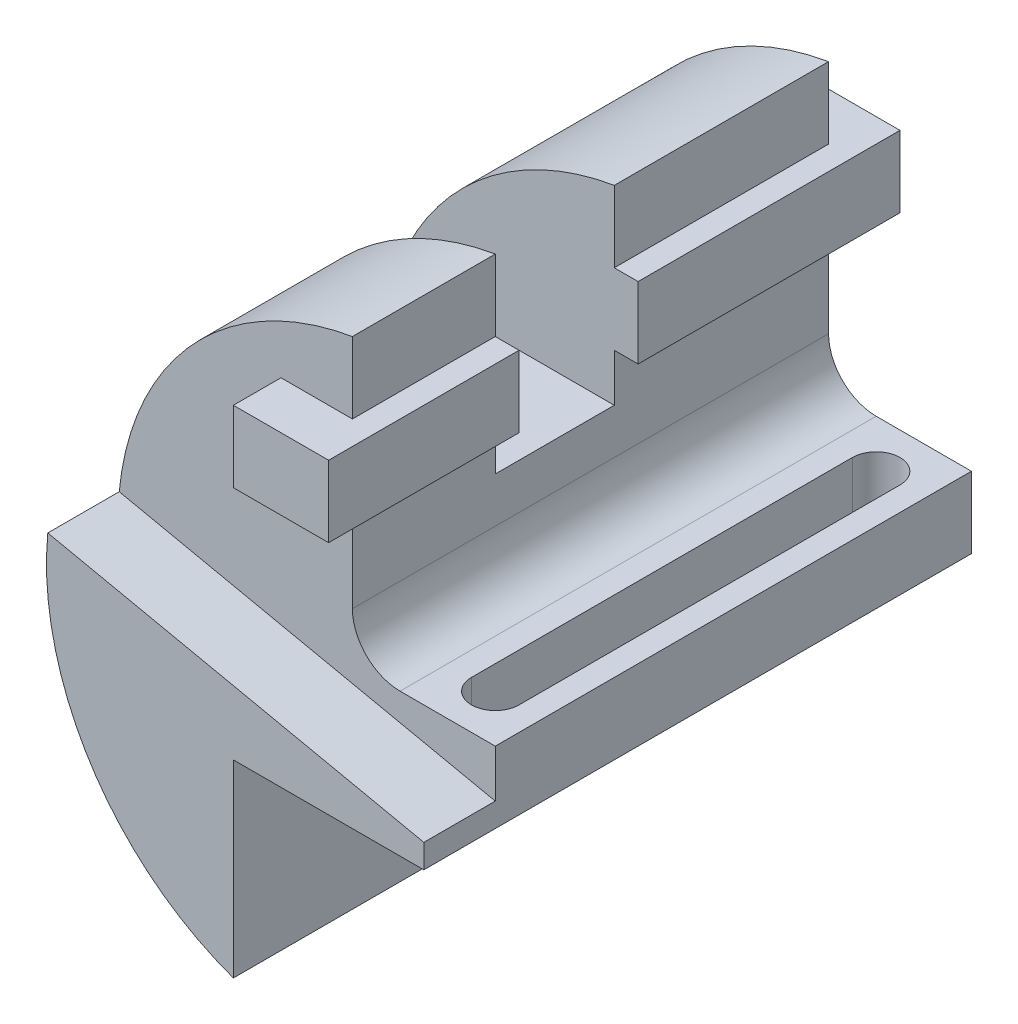
ISO-10303-21;
HEADER;
FILE_DESCRIPTION(('STEP AP214'),'2;1');
FILE_NAME('part.step','',(''),(''),'','','');
FILE_SCHEMA(('AUTOMOTIVE_DESIGN { 1 0 10303 214 1 1 1 1 }'));
ENDSEC;
DATA;
#1=APPLICATION_CONTEXT('core data for automotive mechanical design processes');
#2=APPLICATION_PROTOCOL_DEFINITION('international standard','automotive_design',2000,#1);
#3=PRODUCT_CONTEXT('',#1,'mechanical');
#4=PRODUCT('Part','Part','',(#3));
#5=PRODUCT_RELATED_PRODUCT_CATEGORY('part','',(#4));
#6=PRODUCT_DEFINITION_FORMATION('','',#4);
#7=PRODUCT_DEFINITION_CONTEXT('part definition',#1,'design');
#8=PRODUCT_DEFINITION('design','',#6,#7);
#9=PRODUCT_DEFINITION_SHAPE('','',#8);
#10=(LENGTH_UNIT() NAMED_UNIT(*) SI_UNIT(.MILLI.,.METRE.));
#11=(NAMED_UNIT(*) PLANE_ANGLE_UNIT() SI_UNIT($,.RADIAN.));
#12=(NAMED_UNIT(*) SI_UNIT($,.STERADIAN.) SOLID_ANGLE_UNIT());
#13=UNCERTAINTY_MEASURE_WITH_UNIT(LENGTH_MEASURE(1.E-05),#10,'distance_accuracy_value','');
#14=(GEOMETRIC_REPRESENTATION_CONTEXT(3) GLOBAL_UNCERTAINTY_ASSIGNED_CONTEXT((#13)) GLOBAL_UNIT_ASSIGNED_CONTEXT((#10,
#11,#12)) REPRESENTATION_CONTEXT('',''));
#15=CARTESIAN_POINT('',(0.,0.,0.));
#16=DIRECTION('',(0.,0.,1.));
#17=DIRECTION('',(1.,0.,0.));
#18=AXIS2_PLACEMENT_3D('',#15,#16,#17);
#19=CARTESIAN_POINT('',(0.,-1.09997859589433,-100.));
#20=DIRECTION('',(0.,1.,0.));
#21=DIRECTION('',(0.,0.,1.));
#22=AXIS2_PLACEMENT_3D('',#19,#20,#21);
#23=PLANE('',#22);
#24=DIRECTION('',(-1.,0.,0.));
#25=VECTOR('',#24,1.);
#26=CARTESIAN_POINT('',(0.,-1.09997859589433,0.));
#27=LINE('',#26,#25);
#28=CARTESIAN_POINT('',(20.,-1.09997859589433,0.));
#29=VERTEX_POINT('',#28);
#30=CARTESIAN_POINT('',(0.,-1.09997859589433,0.));
#31=VERTEX_POINT('',#30);
#32=EDGE_CURVE('E290',#29,#31,#27,.T.);
#33=ORIENTED_EDGE('',*,*,#32,.F.);
#34=DIRECTION('',(0.,0.,1.));
#35=VECTOR('',#34,1.);
#36=CARTESIAN_POINT('',(20.,-1.09997859589433,-100.));
#37=LINE('',#36,#35);
#38=CARTESIAN_POINT('',(20.,-1.09997859589433,-100.));
#39=VERTEX_POINT('',#38);
#40=EDGE_CURVE('E284',#39,#29,#37,.T.);
#41=ORIENTED_EDGE('',*,*,#40,.F.);
#42=DIRECTION('',(-1.,0.,0.));
#43=VECTOR('',#42,1.);
#44=CARTESIAN_POINT('',(0.,-1.09997859589433,-100.));
#45=LINE('',#44,#43);
#46=CARTESIAN_POINT('',(0.,-1.09997859589433,-100.));
#47=VERTEX_POINT('',#46);
#48=EDGE_CURVE('E261',#39,#47,#45,.T.);
#49=ORIENTED_EDGE('',*,*,#48,.T.);
#50=DIRECTION('',(0.,0.,1.));
#51=VECTOR('',#50,1.);
#52=CARTESIAN_POINT('',(0.,-1.09997859589433,-100.));
#53=LINE('',#52,#51);
#54=EDGE_CURVE('E256',#47,#31,#53,.T.);
#55=ORIENTED_EDGE('',*,*,#54,.T.);
#56=EDGE_LOOP('',(#33,#41,#49,#55));
#57=FACE_BOUND('',#56,.T.);
#58=DIRECTION('',(0.,0.,-1.));
#59=VECTOR('',#58,1.);
#60=CARTESIAN_POINT('',(5.,-1.09997859589433,-100.));
#61=LINE('',#60,#59);
#62=CARTESIAN_POINT('',(5.00000000000001,-1.09997859589434,-10.));
#63=VERTEX_POINT('',#62);
#64=CARTESIAN_POINT('',(5.,-1.09997859589434,-90.));
#65=VERTEX_POINT('',#64);
#66=EDGE_CURVE('E505',#63,#65,#61,.T.);
#67=ORIENTED_EDGE('',*,*,#66,.T.);
#68=CARTESIAN_POINT('',(10.,-1.09997859589434,-90.));
#69=DIRECTION('',(0.,1.,0.));
#70=DIRECTION('',(0.,0.,1.));
#71=AXIS2_PLACEMENT_3D('',#68,#69,#70);
#72=CIRCLE('',#71,5.);
#73=CARTESIAN_POINT('',(15.,-1.09997859589434,-90.));
#74=VERTEX_POINT('',#73);
#75=EDGE_CURVE('E496',#65,#74,#72,.F.);
#76=ORIENTED_EDGE('',*,*,#75,.T.);
#77=DIRECTION('',(0.,0.,1.));
#78=VECTOR('',#77,1.);
#79=CARTESIAN_POINT('',(15.,-1.09997859589433,-100.));
#80=LINE('',#79,#78);
#81=CARTESIAN_POINT('',(15.,-1.09997859589433,-10.));
#82=VERTEX_POINT('',#81);
#83=EDGE_CURVE('E511',#74,#82,#80,.T.);
#84=ORIENTED_EDGE('',*,*,#83,.T.);
#85=CARTESIAN_POINT('',(10.,-1.09997859589434,-10.));
#86=DIRECTION('',(0.,1.,0.));
#87=DIRECTION('',(0.,0.,1.));
#88=AXIS2_PLACEMENT_3D('',#85,#86,#87);
#89=CIRCLE('',#88,5.);
#90=EDGE_CURVE('E235',#82,#63,#89,.F.);
#91=ORIENTED_EDGE('',*,*,#90,.T.);
#92=EDGE_LOOP('',(#67,#76,#84,#91));
#93=FACE_BOUND('',#92,.T.);
#94=ADVANCED_FACE('F39',(#57,#93),#23,.T.);
#95=CARTESIAN_POINT('',(20.,-16.0999785958943,-100.));
#96=DIRECTION('',(0.,-1.,0.));
#97=DIRECTION('',(1.,0.,0.));
#98=AXIS2_PLACEMENT_3D('',#95,#96,#97);
#99=PLANE('',#98);
#100=DIRECTION('',(0.,0.,1.));
#101=VECTOR('',#100,1.);
#102=CARTESIAN_POINT('',(20.,-16.0999785958943,-100.));
#103=LINE('',#102,#101);
#104=CARTESIAN_POINT('',(20.,-16.0999785958943,-100.));
#105=VERTEX_POINT('',#104);
#106=CARTESIAN_POINT('',(20.,-16.0999785958943,15.));
#107=VERTEX_POINT('',#106);
#108=EDGE_CURVE('E281',#105,#107,#103,.T.);
#109=ORIENTED_EDGE('',*,*,#108,.T.);
#110=DIRECTION('',(1.,0.,0.));
#111=VECTOR('',#110,1.);
#112=CARTESIAN_POINT('',(-20.,-16.0999785958943,15.));
#113=LINE('',#112,#111);
#114=CARTESIAN_POINT('',(-20.,-16.0999785958943,15.));
#115=VERTEX_POINT('',#114);
#116=EDGE_CURVE('E372',#115,#107,#113,.T.);
#117=ORIENTED_EDGE('',*,*,#116,.F.);
#118=DIRECTION('',(0.,0.,1.));
#119=VECTOR('',#118,1.);
#120=CARTESIAN_POINT('',(-20.,-16.0999785958943,-100.));
#121=LINE('',#120,#119);
#122=CARTESIAN_POINT('',(-20.,-16.0999785958943,-100.));
#123=VERTEX_POINT('',#122);
#124=EDGE_CURVE('E278',#123,#115,#121,.T.);
#125=ORIENTED_EDGE('',*,*,#124,.F.);
#126=DIRECTION('',(1.,0.,0.));
#127=VECTOR('',#126,1.);
#128=CARTESIAN_POINT('',(20.,-16.0999785958943,-100.));
#129=LINE('',#128,#127);
#130=EDGE_CURVE('E333',#123,#105,#129,.T.);
#131=ORIENTED_EDGE('',*,*,#130,.T.);
#132=EDGE_LOOP('',(#109,#117,#125,#131));
#133=FACE_BOUND('',#132,.T.);
#134=DIRECTION('',(0.,0.,-1.));
#135=VECTOR('',#134,1.);
#136=CARTESIAN_POINT('',(15.,-16.0999785958943,-100.));
#137=LINE('',#136,#135);
#138=CARTESIAN_POINT('',(15.,-16.0999785958943,-10.));
#139=VERTEX_POINT('',#138);
#140=CARTESIAN_POINT('',(15.,-16.0999785958943,-90.));
#141=VERTEX_POINT('',#140);
#142=EDGE_CURVE('E222',#139,#141,#137,.T.);
#143=ORIENTED_EDGE('',*,*,#142,.T.);
#144=CARTESIAN_POINT('',(10.,-16.0999785958943,-90.));
#145=DIRECTION('',(0.,-1.,0.));
#146=DIRECTION('',(1.,0.,0.));
#147=AXIS2_PLACEMENT_3D('',#144,#145,#146);
#148=CIRCLE('',#147,5.);
#149=CARTESIAN_POINT('',(5.,-16.0999785958943,-90.));
#150=VERTEX_POINT('',#149);
#151=EDGE_CURVE('E11',#141,#150,#148,.F.);
#152=ORIENTED_EDGE('',*,*,#151,.T.);
#153=DIRECTION('',(0.,0.,1.));
#154=VECTOR('',#153,1.);
#155=CARTESIAN_POINT('',(5.,-16.0999785958943,-100.));
#156=LINE('',#155,#154);
#157=CARTESIAN_POINT('',(5.00000000000001,-16.0999785958943,-10.));
#158=VERTEX_POINT('',#157);
#159=EDGE_CURVE('E48',#150,#158,#156,.T.);
#160=ORIENTED_EDGE('',*,*,#159,.T.);
#161=CARTESIAN_POINT('',(10.,-16.0999785958943,-10.));
#162=DIRECTION('',(0.,-1.,0.));
#163=DIRECTION('',(1.,0.,0.));
#164=AXIS2_PLACEMENT_3D('',#161,#162,#163);
#165=CIRCLE('',#164,5.);
#166=EDGE_CURVE('E227',#158,#139,#165,.F.);
#167=ORIENTED_EDGE('',*,*,#166,.T.);
#168=EDGE_LOOP('',(#143,#152,#160,#167));
#169=FACE_BOUND('',#168,.T.);
#170=ADVANCED_FACE('F241',(#133,#169),#99,.T.);
#171=CARTESIAN_POINT('',(-10.,58.4000214041057,-100.));
#172=DIRECTION('',(1.,0.,0.));
#173=DIRECTION('',(0.,1.,0.));
#174=AXIS2_PLACEMENT_3D('',#171,#172,#173);
#175=PLANE('',#174);
#176=DIRECTION('',(0.,-1.,0.));
#177=VECTOR('',#176,1.);
#178=CARTESIAN_POINT('',(-10.,58.4000214041057,-30.));
#179=LINE('',#178,#177);
#180=CARTESIAN_POINT('',(-10.,58.4000214041057,-30.));
#181=VERTEX_POINT('',#180);
#182=CARTESIAN_POINT('',(-10.,43.4000214041057,-30.));
#183=VERTEX_POINT('',#182);
#184=EDGE_CURVE('E398',#181,#183,#179,.T.);
#185=ORIENTED_EDGE('',*,*,#184,.F.);
#186=DIRECTION('',(0.,0.,1.));
#187=VECTOR('',#186,1.);
#188=CARTESIAN_POINT('',(-10.,58.4000214041057,-100.));
#189=LINE('',#188,#187);
#190=CARTESIAN_POINT('',(-10.,58.4000214041057,0.));
#191=VERTEX_POINT('',#190);
#192=EDGE_CURVE('E270',#181,#191,#189,.T.);
#193=ORIENTED_EDGE('',*,*,#192,.T.);
#194=DIRECTION('',(0.,1.,0.));
#195=VECTOR('',#194,1.);
#196=CARTESIAN_POINT('',(-10.,58.4000214041057,0.));
#197=LINE('',#196,#195);
#198=CARTESIAN_POINT('',(-10.,43.4000214041057,0.));
#199=VERTEX_POINT('',#198);
#200=EDGE_CURVE('E301',#199,#191,#197,.T.);
#201=ORIENTED_EDGE('',*,*,#200,.F.);
#202=DIRECTION('',(0.,0.,1.));
#203=VECTOR('',#202,1.);
#204=CARTESIAN_POINT('',(-10.,43.4000214041057,-100.));
#205=LINE('',#204,#203);
#206=EDGE_CURVE('E266',#183,#199,#205,.T.);
#207=ORIENTED_EDGE('',*,*,#206,.F.);
#208=EDGE_LOOP('',(#185,#193,#201,#207));
#209=FACE_BOUND('',#208,.T.);
#210=ADVANCED_FACE('F530',(#209),#175,.T.);
#211=CARTESIAN_POINT('',(0.,8.90002140410567,-100.));
#212=DIRECTION('',(0.,0.,1.));
#213=DIRECTION('',(1.,0.,0.));
#214=AXIS2_PLACEMENT_3D('',#211,#212,#213);
#215=CYLINDRICAL_SURFACE('',#214,10.);
#216=CARTESIAN_POINT('',(0.,8.90002140410567,0.));
#217=DIRECTION('',(0.,0.,-1.));
#218=DIRECTION('',(1.,0.,0.));
#219=AXIS2_PLACEMENT_3D('',#216,#217,#218);
#220=CIRCLE('',#219,10.);
#221=CARTESIAN_POINT('',(-10.,8.90002140410567,0.));
#222=VERTEX_POINT('',#221);
#223=EDGE_CURVE('E321',#31,#222,#220,.T.);
#224=ORIENTED_EDGE('',*,*,#223,.F.);
#225=ORIENTED_EDGE('',*,*,#54,.F.);
#226=CARTESIAN_POINT('',(0.,8.90002140410567,-100.));
#227=DIRECTION('',(0.,0.,-1.));
#228=DIRECTION('',(1.,0.,0.));
#229=AXIS2_PLACEMENT_3D('',#226,#227,#228);
#230=CIRCLE('',#229,10.);
#231=CARTESIAN_POINT('',(-10.,8.90002140410567,-100.));
#232=VERTEX_POINT('',#231);
#233=EDGE_CURVE('E294',#47,#232,#230,.T.);
#234=ORIENTED_EDGE('',*,*,#233,.T.);
#235=DIRECTION('',(0.,0.,1.));
#236=VECTOR('',#235,1.);
#237=CARTESIAN_POINT('',(-10.,8.90002140410567,-100.));
#238=LINE('',#237,#236);
#239=EDGE_CURVE('E257',#232,#222,#238,.T.);
#240=ORIENTED_EDGE('',*,*,#239,.T.);
#241=EDGE_LOOP('',(#224,#225,#234,#240));
#242=FACE_BOUND('',#241,.T.);
#243=ADVANCED_FACE('F41',(#242),#215,.F.);
#244=CARTESIAN_POINT('',(20.,-1.09997859589433,-100.));
#245=DIRECTION('',(1.,0.,0.));
#246=DIRECTION('',(0.,0.,-1.));
#247=AXIS2_PLACEMENT_3D('',#244,#245,#246);
#248=PLANE('',#247);
#249=DIRECTION('',(0.,1.,0.));
#250=VECTOR('',#249,1.);
#251=CARTESIAN_POINT('',(20.,-1.09997859589433,0.));
#252=LINE('',#251,#250);
#253=CARTESIAN_POINT('',(20.,-11.0999785958943,0.));
#254=VERTEX_POINT('',#253);
#255=EDGE_CURVE('E295',#254,#29,#252,.T.);
#256=ORIENTED_EDGE('',*,*,#255,.F.);
#257=DIRECTION('',(0.,0.,-1.));
#258=VECTOR('',#257,1.);
#259=CARTESIAN_POINT('',(20.,-11.0999785958943,15.));
#260=LINE('',#259,#258);
#261=CARTESIAN_POINT('',(20.,-11.0999785958943,15.));
#262=VERTEX_POINT('',#261);
#263=EDGE_CURVE('E325',#262,#254,#260,.T.);
#264=ORIENTED_EDGE('',*,*,#263,.F.);
#265=DIRECTION('',(0.,1.,0.));
#266=VECTOR('',#265,1.);
#267=CARTESIAN_POINT('',(20.,-16.0999785958943,15.));
#268=LINE('',#267,#266);
#269=EDGE_CURVE('E377',#107,#262,#268,.T.);
#270=ORIENTED_EDGE('',*,*,#269,.F.);
#271=ORIENTED_EDGE('',*,*,#108,.F.);
#272=DIRECTION('',(0.,1.,0.));
#273=VECTOR('',#272,1.);
#274=CARTESIAN_POINT('',(20.,-1.09997859589433,-100.));
#275=LINE('',#274,#273);
#276=EDGE_CURVE('E329',#105,#39,#275,.T.);
#277=ORIENTED_EDGE('',*,*,#276,.T.);
#278=ORIENTED_EDGE('',*,*,#40,.T.);
#279=EDGE_LOOP('',(#256,#264,#270,#271,#277,#278));
#280=FACE_BOUND('',#279,.T.);
#281=ADVANCED_FACE('F613',(#280),#248,.T.);
#282=CARTESIAN_POINT('',(-20.,-16.0999785958943,-100.));
#283=DIRECTION('',(1.,0.,0.));
#284=DIRECTION('',(0.,1.,0.));
#285=AXIS2_PLACEMENT_3D('',#282,#283,#284);
#286=PLANE('',#285);
#287=ORIENTED_EDGE('',*,*,#124,.T.);
#288=DIRECTION('',(0.,1.,0.));
#289=VECTOR('',#288,1.);
#290=CARTESIAN_POINT('',(-20.,-55.7724170177338,15.));
#291=LINE('',#290,#289);
#292=CARTESIAN_POINT('',(-20.,-55.7724170177338,15.));
#293=VERTEX_POINT('',#292);
#294=EDGE_CURVE('E382',#293,#115,#291,.T.);
#295=ORIENTED_EDGE('',*,*,#294,.F.);
#296=DIRECTION('',(0.,0.,1.));
#297=VECTOR('',#296,1.);
#298=CARTESIAN_POINT('',(-20.,-55.7724170177338,-100.));
#299=LINE('',#298,#297);
#300=CARTESIAN_POINT('',(-20.,-55.7724170177338,-100.));
#301=VERTEX_POINT('',#300);
#302=EDGE_CURVE('E275',#301,#293,#299,.T.);
#303=ORIENTED_EDGE('',*,*,#302,.F.);
#304=DIRECTION('',(0.,1.,0.));
#305=VECTOR('',#304,1.);
#306=CARTESIAN_POINT('',(-20.,-16.0999785958943,-100.));
#307=LINE('',#306,#305);
#308=EDGE_CURVE('E337',#301,#123,#307,.T.);
#309=ORIENTED_EDGE('',*,*,#308,.T.);
#310=EDGE_LOOP('',(#287,#295,#303,#309));
#311=FACE_BOUND('',#310,.T.);
#312=ADVANCED_FACE('F607',(#311),#286,.T.);
#313=CARTESIAN_POINT('',(0.,0.,-100.));
#314=DIRECTION('',(0.,0.,1.));
#315=DIRECTION('',(1.,0.,0.));
#316=AXIS2_PLACEMENT_3D('',#313,#314,#315);
#317=CYLINDRICAL_SURFACE('',#316,59.25);
#318=CARTESIAN_POINT('',(0.,0.,-30.));
#319=DIRECTION('',(0.,0.,1.));
#320=DIRECTION('',(0.,-1.,0.));
#321=AXIS2_PLACEMENT_3D('',#318,#319,#320);
#322=CIRCLE('',#321,59.25);
#323=CARTESIAN_POINT('',(-56.3205265629544,18.4000214041057,-30.));
#324=VERTEX_POINT('',#323);
#325=EDGE_CURVE('E378',#324,#181,#322,.F.);
#326=ORIENTED_EDGE('',*,*,#325,.F.);
#327=DIRECTION('',(0.,0.,1.));
#328=VECTOR('',#327,1.);
#329=CARTESIAN_POINT('',(-56.3205265629544,18.4000214041057,-100.));
#330=LINE('',#329,#328);
#331=CARTESIAN_POINT('',(-56.3205265629544,18.4000214041057,-55.));
#332=VERTEX_POINT('',#331);
#333=EDGE_CURVE('E408',#332,#324,#330,.T.);
#334=ORIENTED_EDGE('',*,*,#333,.F.);
#335=CARTESIAN_POINT('',(0.,0.,-55.));
#336=DIRECTION('',(0.,0.,-1.));
#337=DIRECTION('',(0.,1.,0.));
#338=AXIS2_PLACEMENT_3D('',#335,#336,#337);
#339=CIRCLE('',#338,59.25);
#340=CARTESIAN_POINT('',(-10.,58.4000214041057,-55.));
#341=VERTEX_POINT('',#340);
#342=EDGE_CURVE('E402',#341,#332,#339,.F.);
#343=ORIENTED_EDGE('',*,*,#342,.F.);
#344=CARTESIAN_POINT('',(-10.,58.4000214041057,-100.));
#345=VERTEX_POINT('',#344);
#346=EDGE_CURVE('E271',#345,#341,#189,.T.);
#347=ORIENTED_EDGE('',*,*,#346,.F.);
#348=CARTESIAN_POINT('',(0.,0.,-100.));
#349=DIRECTION('',(0.,0.,1.));
#350=DIRECTION('',(1.,0.,0.));
#351=AXIS2_PLACEMENT_3D('',#348,#349,#350);
#352=CIRCLE('',#351,59.25);
#353=EDGE_CURVE('E341',#345,#301,#352,.T.);
#354=ORIENTED_EDGE('',*,*,#353,.T.);
#355=ORIENTED_EDGE('',*,*,#302,.T.);
#356=CARTESIAN_POINT('',(0.,0.,15.));
#357=DIRECTION('',(0.,0.,1.));
#358=DIRECTION('',(1.,0.,0.));
#359=AXIS2_PLACEMENT_3D('',#356,#357,#358);
#360=CIRCLE('',#359,59.25);
#361=CARTESIAN_POINT('',(-58.9764421708089,5.68698240486386,15.));
#362=VERTEX_POINT('',#361);
#363=EDGE_CURVE('E386',#362,#293,#360,.T.);
#364=ORIENTED_EDGE('',*,*,#363,.F.);
#365=DIRECTION('',(0.,0.,-1.));
#366=VECTOR('',#365,1.);
#367=CARTESIAN_POINT('',(-58.9764421708089,5.68698240486386,15.));
#368=LINE('',#367,#366);
#369=CARTESIAN_POINT('',(-58.9764421708089,5.68698240486386,0.));
#370=VERTEX_POINT('',#369);
#371=EDGE_CURVE('E368',#362,#370,#368,.T.);
#372=ORIENTED_EDGE('',*,*,#371,.T.);
#373=CARTESIAN_POINT('',(0.,0.,0.));
#374=DIRECTION('',(0.,0.,1.));
#375=DIRECTION('',(1.,0.,0.));
#376=AXIS2_PLACEMENT_3D('',#373,#374,#375);
#377=CIRCLE('',#376,59.25);
#378=EDGE_CURVE('E298',#191,#370,#377,.T.);
#379=ORIENTED_EDGE('',*,*,#378,.F.);
#380=ORIENTED_EDGE('',*,*,#192,.F.);
#381=EDGE_LOOP('',(#326,#334,#343,#347,#354,#355,#364,#372,#379,#380));
#382=FACE_BOUND('',#381,.T.);
#383=ADVANCED_FACE('F534',(#382),#317,.T.);
#384=DIRECTION('',(0.,1.,0.));
#385=VECTOR('',#384,1.);
#386=CARTESIAN_POINT('',(-10.,58.4000214041057,-55.));
#387=LINE('',#386,#385);
#388=CARTESIAN_POINT('',(-10.,43.4000214041057,-55.));
#389=VERTEX_POINT('',#388);
#390=EDGE_CURVE('E405',#389,#341,#387,.T.);
#391=ORIENTED_EDGE('',*,*,#390,.F.);
#392=CARTESIAN_POINT('',(-10.,43.4000214041057,-100.));
#393=VERTEX_POINT('',#392);
#394=EDGE_CURVE('E267',#393,#389,#205,.T.);
#395=ORIENTED_EDGE('',*,*,#394,.F.);
#396=DIRECTION('',(0.,1.,0.));
#397=VECTOR('',#396,1.);
#398=CARTESIAN_POINT('',(-10.,58.4000214041057,-100.));
#399=LINE('',#398,#397);
#400=EDGE_CURVE('E345',#393,#345,#399,.T.);
#401=ORIENTED_EDGE('',*,*,#400,.T.);
#402=ORIENTED_EDGE('',*,*,#346,.T.);
#403=EDGE_LOOP('',(#391,#395,#401,#402));
#404=FACE_BOUND('',#403,.T.);
#405=ADVANCED_FACE('F598',(#404),#175,.T.);
#406=CARTESIAN_POINT('',(-10.,28.4000214041057,-100.));
#407=DIRECTION('',(1.,0.,0.));
#408=DIRECTION('',(0.,1.,0.));
#409=AXIS2_PLACEMENT_3D('',#406,#407,#408);
#410=PLANE('',#409);
#411=DIRECTION('',(0.,-1.,0.));
#412=VECTOR('',#411,1.);
#413=CARTESIAN_POINT('',(-10.,28.4000214041057,-30.));
#414=LINE('',#413,#412);
#415=CARTESIAN_POINT('',(-10.,28.4000214041057,-30.));
#416=VERTEX_POINT('',#415);
#417=CARTESIAN_POINT('',(-10.,18.4000214041057,-30.));
#418=VERTEX_POINT('',#417);
#419=EDGE_CURVE('E228',#416,#418,#414,.T.);
#420=ORIENTED_EDGE('',*,*,#419,.F.);
#421=DIRECTION('',(0.,0.,1.));
#422=VECTOR('',#421,1.);
#423=CARTESIAN_POINT('',(-10.,28.4000214041057,-100.));
#424=LINE('',#423,#422);
#425=CARTESIAN_POINT('',(-10.,28.4000214041057,0.));
#426=VERTEX_POINT('',#425);
#427=EDGE_CURVE('E260',#416,#426,#424,.T.);
#428=ORIENTED_EDGE('',*,*,#427,.T.);
#429=DIRECTION('',(0.,1.,0.));
#430=VECTOR('',#429,1.);
#431=CARTESIAN_POINT('',(-10.,28.4000214041057,0.));
#432=LINE('',#431,#430);
#433=EDGE_CURVE('E317',#222,#426,#432,.T.);
#434=ORIENTED_EDGE('',*,*,#433,.F.);
#435=ORIENTED_EDGE('',*,*,#239,.F.);
#436=DIRECTION('',(0.,1.,0.));
#437=VECTOR('',#436,1.);
#438=CARTESIAN_POINT('',(-10.,28.4000214041057,-100.));
#439=LINE('',#438,#437);
#440=CARTESIAN_POINT('',(-10.,28.4000214041057,-100.));
#441=VERTEX_POINT('',#440);
#442=EDGE_CURVE('E358',#232,#441,#439,.T.);
#443=ORIENTED_EDGE('',*,*,#442,.T.);
#444=CARTESIAN_POINT('',(-10.,28.4000214041057,-55.));
#445=VERTEX_POINT('',#444);
#446=EDGE_CURVE('E262',#441,#445,#424,.T.);
#447=ORIENTED_EDGE('',*,*,#446,.T.);
#448=DIRECTION('',(0.,1.,0.));
#449=VECTOR('',#448,1.);
#450=CARTESIAN_POINT('',(-10.,28.4000214041057,-55.));
#451=LINE('',#450,#449);
#452=CARTESIAN_POINT('',(-10.,18.4000214041057,-55.));
#453=VERTEX_POINT('',#452);
#454=EDGE_CURVE('E249',#453,#445,#451,.T.);
#455=ORIENTED_EDGE('',*,*,#454,.F.);
#456=DIRECTION('',(0.,0.,-1.));
#457=VECTOR('',#456,1.);
#458=CARTESIAN_POINT('',(-10.,18.4000214041057,-100.));
#459=LINE('',#458,#457);
#460=EDGE_CURVE('E253',#418,#453,#459,.T.);
#461=ORIENTED_EDGE('',*,*,#460,.F.);
#462=EDGE_LOOP('',(#420,#428,#434,#435,#443,#447,#455,#461));
#463=FACE_BOUND('',#462,.T.);
#464=ADVANCED_FACE('F570',(#463),#410,.T.);
#465=CARTESIAN_POINT('',(0.,8.90002140410567,-100.));
#466=DIRECTION('',(0.,0.,1.));
#467=DIRECTION('',(1.,0.,0.));
#468=AXIS2_PLACEMENT_3D('',#465,#466,#467);
#469=PLANE('',#468);
#470=ORIENTED_EDGE('',*,*,#233,.F.);
#471=ORIENTED_EDGE('',*,*,#48,.F.);
#472=ORIENTED_EDGE('',*,*,#276,.F.);
#473=ORIENTED_EDGE('',*,*,#130,.F.);
#474=ORIENTED_EDGE('',*,*,#308,.F.);
#475=ORIENTED_EDGE('',*,*,#353,.F.);
#476=ORIENTED_EDGE('',*,*,#400,.F.);
#477=DIRECTION('',(1.,0.,0.));
#478=VECTOR('',#477,1.);
#479=CARTESIAN_POINT('',(-25.,43.4000214041057,-100.));
#480=LINE('',#479,#478);
#481=CARTESIAN_POINT('',(-25.,43.4000214041057,-100.));
#482=VERTEX_POINT('',#481);
#483=EDGE_CURVE('E349',#482,#393,#480,.T.);
#484=ORIENTED_EDGE('',*,*,#483,.F.);
#485=DIRECTION('',(0.,1.,0.));
#486=VECTOR('',#485,1.);
#487=CARTESIAN_POINT('',(-25.,43.4000214041057,-100.));
#488=LINE('',#487,#486);
#489=CARTESIAN_POINT('',(-25.,28.4000214041057,-100.));
#490=VERTEX_POINT('',#489);
#491=EDGE_CURVE('E352',#490,#482,#488,.T.);
#492=ORIENTED_EDGE('',*,*,#491,.F.);
#493=DIRECTION('',(-1.,0.,0.));
#494=VECTOR('',#493,1.);
#495=CARTESIAN_POINT('',(-25.,28.4000214041057,-100.));
#496=LINE('',#495,#494);
#497=EDGE_CURVE('E355',#441,#490,#496,.T.);
#498=ORIENTED_EDGE('',*,*,#497,.F.);
#499=ORIENTED_EDGE('',*,*,#442,.F.);
#500=EDGE_LOOP('',(#470,#471,#472,#473,#474,#475,#476,#484,#492,#498,#499));
#501=FACE_BOUND('',#500,.T.);
#502=ADVANCED_FACE('F579',(#501),#469,.F.);
#503=CARTESIAN_POINT('',(0.,8.90002140410567,0.));
#504=DIRECTION('',(0.,0.,1.));
#505=DIRECTION('',(1.,0.,0.));
#506=AXIS2_PLACEMENT_3D('',#503,#504,#505);
#507=PLANE('',#506);
#508=DIRECTION('',(-0.978147600733806,0.207911690817756,0.));
#509=VECTOR('',#508,1.);
#510=CARTESIAN_POINT('',(20.,-11.0999785958943,0.));
#511=LINE('',#510,#509);
#512=EDGE_CURVE('E373',#254,#370,#511,.T.);
#513=ORIENTED_EDGE('',*,*,#512,.F.);
#514=ORIENTED_EDGE('',*,*,#255,.T.);
#515=ORIENTED_EDGE('',*,*,#32,.T.);
#516=ORIENTED_EDGE('',*,*,#223,.T.);
#517=ORIENTED_EDGE('',*,*,#433,.T.);
#518=DIRECTION('',(-1.,0.,0.));
#519=VECTOR('',#518,1.);
#520=CARTESIAN_POINT('',(-25.,28.4000214041057,0.));
#521=LINE('',#520,#519);
#522=CARTESIAN_POINT('',(-25.,28.4000214041057,0.));
#523=VERTEX_POINT('',#522);
#524=EDGE_CURVE('E313',#426,#523,#521,.T.);
#525=ORIENTED_EDGE('',*,*,#524,.T.);
#526=DIRECTION('',(0.,1.,0.));
#527=VECTOR('',#526,1.);
#528=CARTESIAN_POINT('',(-25.,43.4000214041057,0.));
#529=LINE('',#528,#527);
#530=CARTESIAN_POINT('',(-25.,43.4000214041057,0.));
#531=VERTEX_POINT('',#530);
#532=EDGE_CURVE('E309',#523,#531,#529,.T.);
#533=ORIENTED_EDGE('',*,*,#532,.T.);
#534=DIRECTION('',(1.,0.,0.));
#535=VECTOR('',#534,1.);
#536=CARTESIAN_POINT('',(-25.,43.4000214041057,0.));
#537=LINE('',#536,#535);
#538=EDGE_CURVE('E305',#531,#199,#537,.T.);
#539=ORIENTED_EDGE('',*,*,#538,.T.);
#540=ORIENTED_EDGE('',*,*,#200,.T.);
#541=ORIENTED_EDGE('',*,*,#378,.T.);
#542=EDGE_LOOP('',(#513,#514,#515,#516,#517,#525,#533,#539,#540,#541));
#543=FACE_BOUND('',#542,.T.);
#544=ADVANCED_FACE('F538',(#543),#507,.T.);
#545=CARTESIAN_POINT('',(20.,-11.0999785958943,15.));
#546=DIRECTION('',(-0.207911690817756,-0.978147600733806,0.));
#547=DIRECTION('',(0.978147600733806,-0.207911690817756,0.));
#548=AXIS2_PLACEMENT_3D('',#545,#546,#547);
#549=PLANE('',#548);
#550=ORIENTED_EDGE('',*,*,#512,.T.);
#551=ORIENTED_EDGE('',*,*,#371,.F.);
#552=DIRECTION('',(-0.978147600733806,0.207911690817756,0.));
#553=VECTOR('',#552,1.);
#554=CARTESIAN_POINT('',(20.,-11.0999785958943,15.));
#555=LINE('',#554,#553);
#556=EDGE_CURVE('E390',#262,#362,#555,.T.);
#557=ORIENTED_EDGE('',*,*,#556,.F.);
#558=ORIENTED_EDGE('',*,*,#263,.T.);
#559=EDGE_LOOP('',(#550,#551,#557,#558));
#560=FACE_BOUND('',#559,.T.);
#561=ADVANCED_FACE('F618',(#560),#549,.F.);
#562=CARTESIAN_POINT('',(0.,0.,15.));
#563=DIRECTION('',(0.,0.,1.));
#564=DIRECTION('',(1.,0.,0.));
#565=AXIS2_PLACEMENT_3D('',#562,#563,#564);
#566=PLANE('',#565);
#567=ORIENTED_EDGE('',*,*,#269,.T.);
#568=ORIENTED_EDGE('',*,*,#556,.T.);
#569=ORIENTED_EDGE('',*,*,#363,.T.);
#570=ORIENTED_EDGE('',*,*,#294,.T.);
#571=ORIENTED_EDGE('',*,*,#116,.T.);
#572=EDGE_LOOP('',(#567,#568,#569,#570,#571));
#573=FACE_BOUND('',#572,.T.);
#574=ADVANCED_FACE('F605',(#573),#566,.T.);
#575=CARTESIAN_POINT('',(-59.25,58.4000214041057,-30.));
#576=DIRECTION('',(0.,0.,1.));
#577=DIRECTION('',(0.,-1.,0.));
#578=AXIS2_PLACEMENT_3D('',#575,#576,#577);
#579=PLANE('',#578);
#580=ORIENTED_EDGE('',*,*,#325,.T.);
#581=ORIENTED_EDGE('',*,*,#184,.T.);
#582=DIRECTION('',(1.,0.,0.));
#583=VECTOR('',#582,1.);
#584=CARTESIAN_POINT('',(-5.,43.4000214041057,-30.));
#585=LINE('',#584,#583);
#586=CARTESIAN_POINT('',(-5.,43.4000214041057,-30.));
#587=VERTEX_POINT('',#586);
#588=EDGE_CURVE('E495',#183,#587,#585,.T.);
#589=ORIENTED_EDGE('',*,*,#588,.T.);
#590=DIRECTION('',(0.,-1.,0.));
#591=VECTOR('',#590,1.);
#592=CARTESIAN_POINT('',(-5.,28.4000214041057,-30.));
#593=LINE('',#592,#591);
#594=CARTESIAN_POINT('',(-5.,28.4000214041057,-30.));
#595=VERTEX_POINT('',#594);
#596=EDGE_CURVE('E491',#587,#595,#593,.T.);
#597=ORIENTED_EDGE('',*,*,#596,.T.);
#598=DIRECTION('',(-1.,0.,0.));
#599=VECTOR('',#598,1.);
#600=CARTESIAN_POINT('',(-25.,28.4000214041057,-30.));
#601=LINE('',#600,#599);
#602=EDGE_CURVE('E492',#595,#416,#601,.T.);
#603=ORIENTED_EDGE('',*,*,#602,.T.);
#604=ORIENTED_EDGE('',*,*,#419,.T.);
#605=DIRECTION('',(1.,0.,0.));
#606=VECTOR('',#605,1.);
#607=CARTESIAN_POINT('',(-59.25,18.4000214041057,-30.));
#608=LINE('',#607,#606);
#609=EDGE_CURVE('E412',#324,#418,#608,.T.);
#610=ORIENTED_EDGE('',*,*,#609,.F.);
#611=EDGE_LOOP('',(#580,#581,#589,#597,#603,#604,#610));
#612=FACE_BOUND('',#611,.T.);
#613=ADVANCED_FACE('F557',(#612),#579,.F.);
#614=CARTESIAN_POINT('',(-59.25,58.4000214041057,-55.));
#615=DIRECTION('',(0.,0.,-1.));
#616=DIRECTION('',(0.,1.,0.));
#617=AXIS2_PLACEMENT_3D('',#614,#615,#616);
#618=PLANE('',#617);
#619=DIRECTION('',(-1.,0.,0.));
#620=VECTOR('',#619,1.);
#621=CARTESIAN_POINT('',(-25.,43.4000214041057,-55.));
#622=LINE('',#621,#620);
#623=CARTESIAN_POINT('',(-5.,43.4000214041057,-55.));
#624=VERTEX_POINT('',#623);
#625=EDGE_CURVE('E449',#624,#389,#622,.T.);
#626=ORIENTED_EDGE('',*,*,#625,.T.);
#627=ORIENTED_EDGE('',*,*,#390,.T.);
#628=ORIENTED_EDGE('',*,*,#342,.T.);
#629=DIRECTION('',(1.,0.,0.));
#630=VECTOR('',#629,1.);
#631=CARTESIAN_POINT('',(-59.25,18.4000214041057,-55.));
#632=LINE('',#631,#630);
#633=EDGE_CURVE('E411',#332,#453,#632,.T.);
#634=ORIENTED_EDGE('',*,*,#633,.T.);
#635=ORIENTED_EDGE('',*,*,#454,.T.);
#636=DIRECTION('',(1.,0.,0.));
#637=VECTOR('',#636,1.);
#638=CARTESIAN_POINT('',(-25.,28.4000214041057,-55.));
#639=LINE('',#638,#637);
#640=CARTESIAN_POINT('',(-5.,28.4000214041057,-55.));
#641=VERTEX_POINT('',#640);
#642=EDGE_CURVE('E450',#445,#641,#639,.T.);
#643=ORIENTED_EDGE('',*,*,#642,.T.);
#644=DIRECTION('',(0.,1.,0.));
#645=VECTOR('',#644,1.);
#646=CARTESIAN_POINT('',(-5.,43.4000214041057,-55.));
#647=LINE('',#646,#645);
#648=EDGE_CURVE('E453',#641,#624,#647,.T.);
#649=ORIENTED_EDGE('',*,*,#648,.T.);
#650=EDGE_LOOP('',(#626,#627,#628,#634,#635,#643,#649));
#651=FACE_BOUND('',#650,.T.);
#652=ADVANCED_FACE('F567',(#651),#618,.F.);
#653=CARTESIAN_POINT('',(-59.25,18.4000214041057,-30.));
#654=DIRECTION('',(0.,-1.,0.));
#655=DIRECTION('',(0.,0.,-1.));
#656=AXIS2_PLACEMENT_3D('',#653,#654,#655);
#657=PLANE('',#656);
#658=ORIENTED_EDGE('',*,*,#333,.T.);
#659=ORIENTED_EDGE('',*,*,#609,.T.);
#660=ORIENTED_EDGE('',*,*,#460,.T.);
#661=ORIENTED_EDGE('',*,*,#633,.F.);
#662=EDGE_LOOP('',(#658,#659,#660,#661));
#663=FACE_BOUND('',#662,.T.);
#664=ADVANCED_FACE('F563',(#663),#657,.F.);
#665=CARTESIAN_POINT('',(-25.,43.4000214041057,-135.));
#666=DIRECTION('',(-1.,0.,0.));
#667=DIRECTION('',(0.,-1.,0.));
#668=AXIS2_PLACEMENT_3D('',#665,#666,#667);
#669=PLANE('',#668);
#670=ORIENTED_EDGE('',*,*,#491,.T.);
#671=DIRECTION('',(0.,0.,1.));
#672=VECTOR('',#671,1.);
#673=CARTESIAN_POINT('',(-25.,43.4000214041057,-135.));
#674=LINE('',#673,#672);
#675=CARTESIAN_POINT('',(-25.,43.4000214041057,-110.));
#676=VERTEX_POINT('',#675);
#677=EDGE_CURVE('E433',#676,#482,#674,.T.);
#678=ORIENTED_EDGE('',*,*,#677,.F.);
#679=DIRECTION('',(0.,-1.,0.));
#680=VECTOR('',#679,1.);
#681=CARTESIAN_POINT('',(-25.,43.4000214041057,-110.));
#682=LINE('',#681,#680);
#683=CARTESIAN_POINT('',(-25.,28.4000214041057,-110.));
#684=VERTEX_POINT('',#683);
#685=EDGE_CURVE('E422',#676,#684,#682,.T.);
#686=ORIENTED_EDGE('',*,*,#685,.T.);
#687=DIRECTION('',(0.,0.,1.));
#688=VECTOR('',#687,1.);
#689=CARTESIAN_POINT('',(-25.,28.4000214041057,-135.));
#690=LINE('',#689,#688);
#691=EDGE_CURVE('E415',#684,#490,#690,.T.);
#692=ORIENTED_EDGE('',*,*,#691,.T.);
#693=EDGE_LOOP('',(#670,#678,#686,#692));
#694=FACE_BOUND('',#693,.T.);
#695=ADVANCED_FACE('F584',(#694),#669,.T.);
#696=CARTESIAN_POINT('',(0.,0.,-110.));
#697=DIRECTION('',(0.,0.,-1.));
#698=DIRECTION('',(-1.,0.,0.));
#699=AXIS2_PLACEMENT_3D('',#696,#697,#698);
#700=PLANE('',#699);
#701=ORIENTED_EDGE('',*,*,#685,.F.);
#702=DIRECTION('',(-1.,0.,0.));
#703=VECTOR('',#702,1.);
#704=CARTESIAN_POINT('',(-25.,43.4000214041057,-110.));
#705=LINE('',#704,#703);
#706=CARTESIAN_POINT('',(-5.,43.4000214041057,-110.));
#707=VERTEX_POINT('',#706);
#708=EDGE_CURVE('E432',#707,#676,#705,.T.);
#709=ORIENTED_EDGE('',*,*,#708,.F.);
#710=DIRECTION('',(0.,1.,0.));
#711=VECTOR('',#710,1.);
#712=CARTESIAN_POINT('',(-5.,43.4000214041057,-110.));
#713=LINE('',#712,#711);
#714=CARTESIAN_POINT('',(-5.,28.4000214041057,-110.));
#715=VERTEX_POINT('',#714);
#716=EDGE_CURVE('E427',#715,#707,#713,.T.);
#717=ORIENTED_EDGE('',*,*,#716,.F.);
#718=DIRECTION('',(1.,0.,0.));
#719=VECTOR('',#718,1.);
#720=CARTESIAN_POINT('',(-25.,28.4000214041057,-110.));
#721=LINE('',#720,#719);
#722=EDGE_CURVE('E428',#684,#715,#721,.T.);
#723=ORIENTED_EDGE('',*,*,#722,.F.);
#724=EDGE_LOOP('',(#701,#709,#717,#723));
#725=FACE_BOUND('',#724,.T.);
#726=ADVANCED_FACE('F591',(#725),#700,.T.);
#727=CARTESIAN_POINT('',(-25.,28.4000214041057,-135.));
#728=DIRECTION('',(0.,-1.,0.));
#729=DIRECTION('',(0.,0.,-1.));
#730=AXIS2_PLACEMENT_3D('',#727,#728,#729);
#731=PLANE('',#730);
#732=ORIENTED_EDGE('',*,*,#642,.F.);
#733=ORIENTED_EDGE('',*,*,#446,.F.);
#734=ORIENTED_EDGE('',*,*,#497,.T.);
#735=ORIENTED_EDGE('',*,*,#691,.F.);
#736=ORIENTED_EDGE('',*,*,#722,.T.);
#737=DIRECTION('',(0.,0.,1.));
#738=VECTOR('',#737,1.);
#739=CARTESIAN_POINT('',(-5.,28.4000214041057,-135.));
#740=LINE('',#739,#738);
#741=EDGE_CURVE('E423',#715,#641,#740,.T.);
#742=ORIENTED_EDGE('',*,*,#741,.T.);
#743=EDGE_LOOP('',(#732,#733,#734,#735,#736,#742));
#744=FACE_BOUND('',#743,.T.);
#745=ADVANCED_FACE('F574',(#744),#731,.T.);
#746=CARTESIAN_POINT('',(-5.,43.4000214041057,-135.));
#747=DIRECTION('',(1.,0.,0.));
#748=DIRECTION('',(0.,1.,0.));
#749=AXIS2_PLACEMENT_3D('',#746,#747,#748);
#750=PLANE('',#749);
#751=ORIENTED_EDGE('',*,*,#741,.F.);
#752=ORIENTED_EDGE('',*,*,#716,.T.);
#753=DIRECTION('',(0.,0.,1.));
#754=VECTOR('',#753,1.);
#755=CARTESIAN_POINT('',(-5.,43.4000214041057,-135.));
#756=LINE('',#755,#754);
#757=EDGE_CURVE('E429',#707,#624,#756,.T.);
#758=ORIENTED_EDGE('',*,*,#757,.T.);
#759=ORIENTED_EDGE('',*,*,#648,.F.);
#760=EDGE_LOOP('',(#751,#752,#758,#759));
#761=FACE_BOUND('',#760,.T.);
#762=ADVANCED_FACE('F595',(#761),#750,.T.);
#763=CARTESIAN_POINT('',(-25.,43.4000214041057,-135.));
#764=DIRECTION('',(0.,1.,0.));
#765=DIRECTION('',(0.,0.,1.));
#766=AXIS2_PLACEMENT_3D('',#763,#764,#765);
#767=PLANE('',#766);
#768=ORIENTED_EDGE('',*,*,#483,.T.);
#769=ORIENTED_EDGE('',*,*,#394,.T.);
#770=ORIENTED_EDGE('',*,*,#625,.F.);
#771=ORIENTED_EDGE('',*,*,#757,.F.);
#772=ORIENTED_EDGE('',*,*,#708,.T.);
#773=ORIENTED_EDGE('',*,*,#677,.T.);
#774=EDGE_LOOP('',(#768,#769,#770,#771,#772,#773));
#775=FACE_BOUND('',#774,.T.);
#776=ADVANCED_FACE('F586',(#775),#767,.T.);
#777=CARTESIAN_POINT('',(0.,0.,10.));
#778=DIRECTION('',(0.,0.,1.));
#779=DIRECTION('',(1.,0.,0.));
#780=AXIS2_PLACEMENT_3D('',#777,#778,#779);
#781=PLANE('',#780);
#782=DIRECTION('',(-1.,0.,0.));
#783=VECTOR('',#782,1.);
#784=CARTESIAN_POINT('',(-25.,28.4000214041057,10.));
#785=LINE('',#784,#783);
#786=CARTESIAN_POINT('',(-5.,28.4000214041057,10.));
#787=VERTEX_POINT('',#786);
#788=CARTESIAN_POINT('',(-25.,28.4000214041057,10.));
#789=VERTEX_POINT('',#788);
#790=EDGE_CURVE('E464',#787,#789,#785,.T.);
#791=ORIENTED_EDGE('',*,*,#790,.F.);
#792=DIRECTION('',(0.,-1.,0.));
#793=VECTOR('',#792,1.);
#794=CARTESIAN_POINT('',(-5.,28.4000214041057,10.));
#795=LINE('',#794,#793);
#796=CARTESIAN_POINT('',(-5.,43.4000214041057,10.));
#797=VERTEX_POINT('',#796);
#798=EDGE_CURVE('E475',#797,#787,#795,.T.);
#799=ORIENTED_EDGE('',*,*,#798,.F.);
#800=DIRECTION('',(1.,0.,0.));
#801=VECTOR('',#800,1.);
#802=CARTESIAN_POINT('',(-5.,43.4000214041057,10.));
#803=LINE('',#802,#801);
#804=CARTESIAN_POINT('',(-25.,43.4000214041057,10.));
#805=VERTEX_POINT('',#804);
#806=EDGE_CURVE('E469',#805,#797,#803,.T.);
#807=ORIENTED_EDGE('',*,*,#806,.F.);
#808=DIRECTION('',(0.,1.,0.));
#809=VECTOR('',#808,1.);
#810=CARTESIAN_POINT('',(-25.,28.4000214041057,10.));
#811=LINE('',#810,#809);
#812=EDGE_CURVE('E470',#789,#805,#811,.T.);
#813=ORIENTED_EDGE('',*,*,#812,.F.);
#814=EDGE_LOOP('',(#791,#799,#807,#813));
#815=FACE_BOUND('',#814,.T.);
#816=ADVANCED_FACE('F546',(#815),#781,.T.);
#817=CARTESIAN_POINT('',(-25.,28.4000214041057,35.));
#818=DIRECTION('',(-1.,0.,0.));
#819=DIRECTION('',(0.,-1.,0.));
#820=AXIS2_PLACEMENT_3D('',#817,#818,#819);
#821=PLANE('',#820);
#822=DIRECTION('',(0.,0.,-1.));
#823=VECTOR('',#822,1.);
#824=CARTESIAN_POINT('',(-25.,43.4000214041057,35.));
#825=LINE('',#824,#823);
#826=EDGE_CURVE('E465',#805,#531,#825,.T.);
#827=ORIENTED_EDGE('',*,*,#826,.T.);
#828=ORIENTED_EDGE('',*,*,#532,.F.);
#829=DIRECTION('',(0.,0.,-1.));
#830=VECTOR('',#829,1.);
#831=CARTESIAN_POINT('',(-25.,28.4000214041057,35.));
#832=LINE('',#831,#830);
#833=EDGE_CURVE('E454',#789,#523,#832,.T.);
#834=ORIENTED_EDGE('',*,*,#833,.F.);
#835=ORIENTED_EDGE('',*,*,#812,.T.);
#836=EDGE_LOOP('',(#827,#828,#834,#835));
#837=FACE_BOUND('',#836,.T.);
#838=ADVANCED_FACE('F543',(#837),#821,.T.);
#839=CARTESIAN_POINT('',(-5.,43.4000214041057,35.));
#840=DIRECTION('',(0.,1.,0.));
#841=DIRECTION('',(0.,0.,1.));
#842=AXIS2_PLACEMENT_3D('',#839,#840,#841);
#843=PLANE('',#842);
#844=ORIENTED_EDGE('',*,*,#588,.F.);
#845=ORIENTED_EDGE('',*,*,#206,.T.);
#846=ORIENTED_EDGE('',*,*,#538,.F.);
#847=ORIENTED_EDGE('',*,*,#826,.F.);
#848=ORIENTED_EDGE('',*,*,#806,.T.);
#849=DIRECTION('',(0.,0.,-1.));
#850=VECTOR('',#849,1.);
#851=CARTESIAN_POINT('',(-5.,43.4000214041057,35.));
#852=LINE('',#851,#850);
#853=EDGE_CURVE('E471',#797,#587,#852,.T.);
#854=ORIENTED_EDGE('',*,*,#853,.T.);
#855=EDGE_LOOP('',(#844,#845,#846,#847,#848,#854));
#856=FACE_BOUND('',#855,.T.);
#857=ADVANCED_FACE('F541',(#856),#843,.T.);
#858=CARTESIAN_POINT('',(-5.,28.4000214041057,35.));
#859=DIRECTION('',(1.,0.,0.));
#860=DIRECTION('',(0.,1.,0.));
#861=AXIS2_PLACEMENT_3D('',#858,#859,#860);
#862=PLANE('',#861);
#863=ORIENTED_EDGE('',*,*,#853,.F.);
#864=ORIENTED_EDGE('',*,*,#798,.T.);
#865=DIRECTION('',(0.,0.,-1.));
#866=VECTOR('',#865,1.);
#867=CARTESIAN_POINT('',(-5.,28.4000214041057,35.));
#868=LINE('',#867,#866);
#869=EDGE_CURVE('E476',#787,#595,#868,.T.);
#870=ORIENTED_EDGE('',*,*,#869,.T.);
#871=ORIENTED_EDGE('',*,*,#596,.F.);
#872=EDGE_LOOP('',(#863,#864,#870,#871));
#873=FACE_BOUND('',#872,.T.);
#874=ADVANCED_FACE('F555',(#873),#862,.T.);
#875=CARTESIAN_POINT('',(-25.,28.4000214041057,35.));
#876=DIRECTION('',(0.,-1.,0.));
#877=DIRECTION('',(0.,0.,-1.));
#878=AXIS2_PLACEMENT_3D('',#875,#876,#877);
#879=PLANE('',#878);
#880=ORIENTED_EDGE('',*,*,#524,.F.);
#881=ORIENTED_EDGE('',*,*,#427,.F.);
#882=ORIENTED_EDGE('',*,*,#602,.F.);
#883=ORIENTED_EDGE('',*,*,#869,.F.);
#884=ORIENTED_EDGE('',*,*,#790,.T.);
#885=ORIENTED_EDGE('',*,*,#833,.T.);
#886=EDGE_LOOP('',(#880,#881,#882,#883,#884,#885));
#887=FACE_BOUND('',#886,.T.);
#888=ADVANCED_FACE('F549',(#887),#879,.T.);
#889=CARTESIAN_POINT('',(10.,58.4000214041057,-90.));
#890=DIRECTION('',(0.,-1.,0.));
#891=DIRECTION('',(0.,0.,-1.));
#892=AXIS2_PLACEMENT_3D('',#889,#890,#891);
#893=CYLINDRICAL_SURFACE('',#892,5.);
#894=DIRECTION('',(0.,-1.,0.));
#895=VECTOR('',#894,1.);
#896=CARTESIAN_POINT('',(5.,58.4000214041057,-90.));
#897=LINE('',#896,#895);
#898=EDGE_CURVE('E514',#65,#150,#897,.T.);
#899=ORIENTED_EDGE('',*,*,#898,.T.);
#900=ORIENTED_EDGE('',*,*,#151,.F.);
#901=DIRECTION('',(0.,-1.,0.));
#902=VECTOR('',#901,1.);
#903=CARTESIAN_POINT('',(15.,58.4000214041057,-90.));
#904=LINE('',#903,#902);
#905=EDGE_CURVE('E60',#74,#141,#904,.T.);
#906=ORIENTED_EDGE('',*,*,#905,.F.);
#907=ORIENTED_EDGE('',*,*,#75,.F.);
#908=EDGE_LOOP('',(#899,#900,#906,#907));
#909=FACE_BOUND('',#908,.T.);
#910=ADVANCED_FACE('F682',(#909),#893,.F.);
#911=CARTESIAN_POINT('',(5.,58.4000214041057,-90.));
#912=DIRECTION('',(1.,0.,0.));
#913=DIRECTION('',(0.,0.,-1.));
#914=AXIS2_PLACEMENT_3D('',#911,#912,#913);
#915=PLANE('',#914);
#916=DIRECTION('',(0.,-1.,0.));
#917=VECTOR('',#916,1.);
#918=CARTESIAN_POINT('',(5.00000000000001,58.4000214041057,-10.));
#919=LINE('',#918,#917);
#920=EDGE_CURVE('E238',#63,#158,#919,.T.);
#921=ORIENTED_EDGE('',*,*,#920,.T.);
#922=ORIENTED_EDGE('',*,*,#159,.F.);
#923=ORIENTED_EDGE('',*,*,#898,.F.);
#924=ORIENTED_EDGE('',*,*,#66,.F.);
#925=EDGE_LOOP('',(#921,#922,#923,#924));
#926=FACE_BOUND('',#925,.T.);
#927=ADVANCED_FACE('F685',(#926),#915,.T.);
#928=CARTESIAN_POINT('',(10.,58.4000214041057,-10.));
#929=DIRECTION('',(0.,-1.,0.));
#930=DIRECTION('',(0.,0.,-1.));
#931=AXIS2_PLACEMENT_3D('',#928,#929,#930);
#932=CYLINDRICAL_SURFACE('',#931,5.);
#933=DIRECTION('',(0.,-1.,0.));
#934=VECTOR('',#933,1.);
#935=CARTESIAN_POINT('',(15.,58.4000214041057,-10.));
#936=LINE('',#935,#934);
#937=EDGE_CURVE('E55',#82,#139,#936,.T.);
#938=ORIENTED_EDGE('',*,*,#937,.T.);
#939=ORIENTED_EDGE('',*,*,#166,.F.);
#940=ORIENTED_EDGE('',*,*,#920,.F.);
#941=ORIENTED_EDGE('',*,*,#90,.F.);
#942=EDGE_LOOP('',(#938,#939,#940,#941));
#943=FACE_BOUND('',#942,.T.);
#944=ADVANCED_FACE('F231',(#943),#932,.F.);
#945=CARTESIAN_POINT('',(15.,58.4000214041057,-90.));
#946=DIRECTION('',(-1.,0.,0.));
#947=DIRECTION('',(0.,0.,1.));
#948=AXIS2_PLACEMENT_3D('',#945,#946,#947);
#949=PLANE('',#948);
#950=ORIENTED_EDGE('',*,*,#905,.T.);
#951=ORIENTED_EDGE('',*,*,#142,.F.);
#952=ORIENTED_EDGE('',*,*,#937,.F.);
#953=ORIENTED_EDGE('',*,*,#83,.F.);
#954=EDGE_LOOP('',(#950,#951,#952,#953));
#955=FACE_BOUND('',#954,.T.);
#956=ADVANCED_FACE('F223',(#955),#949,.T.);
#957=CLOSED_SHELL('',(#94,#170,#210,#243,#281,#312,#383,#405,#464,#502,#544,#561,#574,#613,#652,
#664,#695,#726,#745,#762,#776,#816,#838,#857,#874,#888,#910,#927,#944,#956));
#958=MANIFOLD_SOLID_BREP('B2',#957);
#959=ADVANCED_BREP_SHAPE_REPRESENTATION('',(#18,#958),#14);
#960=SHAPE_DEFINITION_REPRESENTATION(#9,#959);
ENDSEC;
END-ISO-10303-21;
